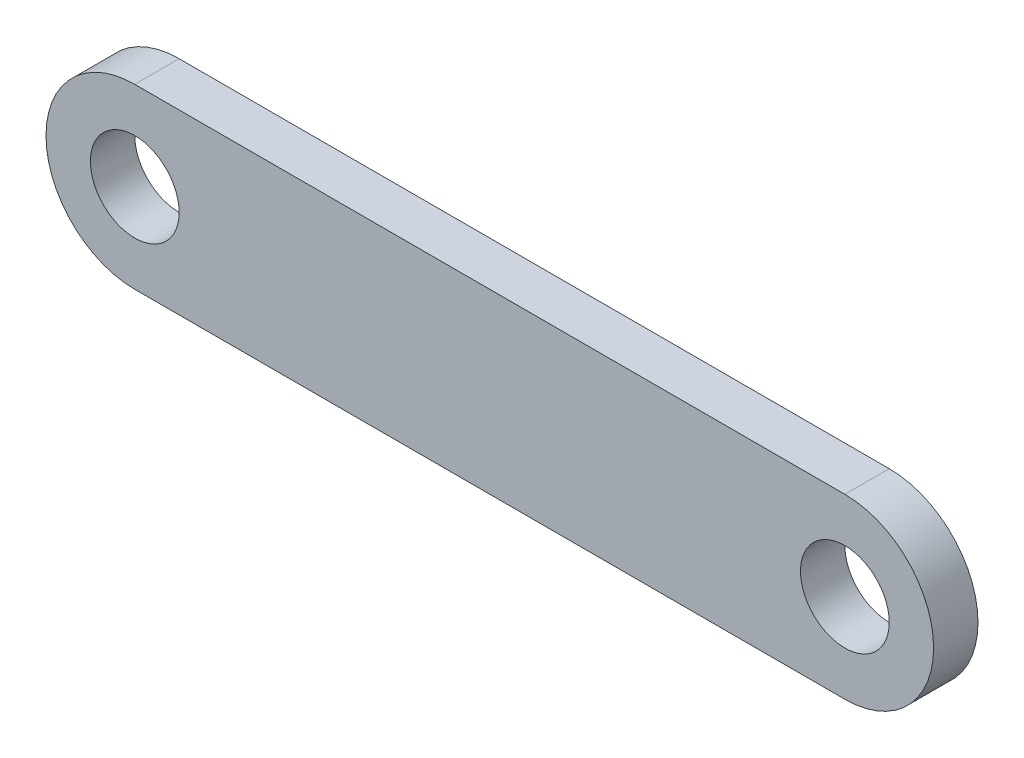
ISO-10303-21;
HEADER;
FILE_DESCRIPTION(('STEP AP214'),'2;1');
FILE_NAME('part.step','',(''),(''),'','','');
FILE_SCHEMA(('AUTOMOTIVE_DESIGN { 1 0 10303 214 1 1 1 1 }'));
ENDSEC;
DATA;
#1=APPLICATION_CONTEXT('core data for automotive mechanical design processes');
#2=APPLICATION_PROTOCOL_DEFINITION('international standard','automotive_design',2000,#1);
#3=PRODUCT_CONTEXT('',#1,'mechanical');
#4=PRODUCT('Part','Part','',(#3));
#5=PRODUCT_RELATED_PRODUCT_CATEGORY('part','',(#4));
#6=PRODUCT_DEFINITION_FORMATION('','',#4);
#7=PRODUCT_DEFINITION_CONTEXT('part definition',#1,'design');
#8=PRODUCT_DEFINITION('design','',#6,#7);
#9=PRODUCT_DEFINITION_SHAPE('','',#8);
#10=(LENGTH_UNIT() NAMED_UNIT(*) SI_UNIT(.MILLI.,.METRE.));
#11=(NAMED_UNIT(*) PLANE_ANGLE_UNIT() SI_UNIT($,.RADIAN.));
#12=(NAMED_UNIT(*) SI_UNIT($,.STERADIAN.) SOLID_ANGLE_UNIT());
#13=UNCERTAINTY_MEASURE_WITH_UNIT(LENGTH_MEASURE(1.E-05),#10,'distance_accuracy_value','');
#14=(GEOMETRIC_REPRESENTATION_CONTEXT(3) GLOBAL_UNCERTAINTY_ASSIGNED_CONTEXT((#13)) GLOBAL_UNIT_ASSIGNED_CONTEXT((#10,
#11,#12)) REPRESENTATION_CONTEXT('',''));
#15=CARTESIAN_POINT('',(0.,0.,0.));
#16=DIRECTION('',(0.,0.,1.));
#17=DIRECTION('',(1.,0.,0.));
#18=AXIS2_PLACEMENT_3D('',#15,#16,#17);
#19=CARTESIAN_POINT('',(-16.,0.,1.));
#20=DIRECTION('',(0.,0.,1.));
#21=DIRECTION('',(1.,0.,0.));
#22=AXIS2_PLACEMENT_3D('',#19,#20,#21);
#23=PLANE('',#22);
#24=CARTESIAN_POINT('',(-16.,0.,1.));
#25=DIRECTION('',(0.,0.,1.));
#26=DIRECTION('',(1.,0.,0.));
#27=AXIS2_PLACEMENT_3D('',#24,#25,#26);
#28=CIRCLE('',#27,2.);
#29=CARTESIAN_POINT('',(-14.,0.,1.));
#30=VERTEX_POINT('',#29);
#31=EDGE_CURVE('E116',#30,#30,#28,.T.);
#32=ORIENTED_EDGE('',*,*,#31,.F.);
#33=EDGE_LOOP('',(#32));
#34=FACE_BOUND('',#33,.T.);
#35=CARTESIAN_POINT('',(-16.,0.,1.));
#36=DIRECTION('',(0.,0.,1.));
#37=DIRECTION('',(1.,0.,0.));
#38=AXIS2_PLACEMENT_3D('',#35,#36,#37);
#39=CIRCLE('',#38,4.);
#40=CARTESIAN_POINT('',(-16.,4.,1.));
#41=VERTEX_POINT('',#40);
#42=CARTESIAN_POINT('',(-16.,-4.,1.));
#43=VERTEX_POINT('',#42);
#44=EDGE_CURVE('E96',#41,#43,#39,.T.);
#45=ORIENTED_EDGE('',*,*,#44,.T.);
#46=DIRECTION('',(1.,0.,0.));
#47=VECTOR('',#46,1.);
#48=CARTESIAN_POINT('',(-16.,-4.,1.));
#49=LINE('',#48,#47);
#50=CARTESIAN_POINT('',(16.,-4.,1.));
#51=VERTEX_POINT('',#50);
#52=EDGE_CURVE('E91',#43,#51,#49,.T.);
#53=ORIENTED_EDGE('',*,*,#52,.T.);
#54=CARTESIAN_POINT('',(16.,0.,1.));
#55=DIRECTION('',(0.,0.,1.));
#56=DIRECTION('',(1.,0.,0.));
#57=AXIS2_PLACEMENT_3D('',#54,#55,#56);
#58=CIRCLE('',#57,4.);
#59=CARTESIAN_POINT('',(16.,4.,1.));
#60=VERTEX_POINT('',#59);
#61=EDGE_CURVE('E94',#51,#60,#58,.T.);
#62=ORIENTED_EDGE('',*,*,#61,.T.);
#63=DIRECTION('',(-1.,0.,0.));
#64=VECTOR('',#63,1.);
#65=CARTESIAN_POINT('',(-16.,4.,1.));
#66=LINE('',#65,#64);
#67=EDGE_CURVE('E61',#60,#41,#66,.T.);
#68=ORIENTED_EDGE('',*,*,#67,.T.);
#69=EDGE_LOOP('',(#45,#53,#62,#68));
#70=FACE_BOUND('',#69,.T.);
#71=CARTESIAN_POINT('',(16.,0.,1.));
#72=DIRECTION('',(0.,0.,1.));
#73=DIRECTION('',(1.,0.,0.));
#74=AXIS2_PLACEMENT_3D('',#71,#72,#73);
#75=CIRCLE('',#74,2.);
#76=CARTESIAN_POINT('',(18.,0.,1.));
#77=VERTEX_POINT('',#76);
#78=EDGE_CURVE('E138',#77,#77,#75,.T.);
#79=ORIENTED_EDGE('',*,*,#78,.F.);
#80=EDGE_LOOP('',(#79));
#81=FACE_BOUND('',#80,.T.);
#82=ADVANCED_FACE('F43',(#34,#70,#81),#23,.T.);
#83=CARTESIAN_POINT('',(-16.,0.,-1.));
#84=DIRECTION('',(0.,0.,1.));
#85=DIRECTION('',(1.,0.,0.));
#86=AXIS2_PLACEMENT_3D('',#83,#84,#85);
#87=PLANE('',#86);
#88=CARTESIAN_POINT('',(-16.,0.,-1.));
#89=DIRECTION('',(0.,0.,1.));
#90=DIRECTION('',(1.,0.,0.));
#91=AXIS2_PLACEMENT_3D('',#88,#89,#90);
#92=CIRCLE('',#91,4.);
#93=CARTESIAN_POINT('',(-16.,4.,-1.));
#94=VERTEX_POINT('',#93);
#95=CARTESIAN_POINT('',(-16.,-4.,-1.));
#96=VERTEX_POINT('',#95);
#97=EDGE_CURVE('E112',#94,#96,#92,.T.);
#98=ORIENTED_EDGE('',*,*,#97,.F.);
#99=DIRECTION('',(-1.,0.,0.));
#100=VECTOR('',#99,1.);
#101=CARTESIAN_POINT('',(-16.,4.,-1.));
#102=LINE('',#101,#100);
#103=CARTESIAN_POINT('',(16.,4.,-1.));
#104=VERTEX_POINT('',#103);
#105=EDGE_CURVE('E84',#104,#94,#102,.T.);
#106=ORIENTED_EDGE('',*,*,#105,.F.);
#107=CARTESIAN_POINT('',(16.,0.,-1.));
#108=DIRECTION('',(0.,0.,1.));
#109=DIRECTION('',(1.,0.,0.));
#110=AXIS2_PLACEMENT_3D('',#107,#108,#109);
#111=CIRCLE('',#110,4.);
#112=CARTESIAN_POINT('',(16.,-4.,-1.));
#113=VERTEX_POINT('',#112);
#114=EDGE_CURVE('E78',#113,#104,#111,.T.);
#115=ORIENTED_EDGE('',*,*,#114,.F.);
#116=DIRECTION('',(1.,0.,0.));
#117=VECTOR('',#116,1.);
#118=CARTESIAN_POINT('',(-16.,-4.,-1.));
#119=LINE('',#118,#117);
#120=EDGE_CURVE('E101',#96,#113,#119,.T.);
#121=ORIENTED_EDGE('',*,*,#120,.F.);
#122=EDGE_LOOP('',(#98,#106,#115,#121));
#123=FACE_BOUND('',#122,.T.);
#124=CARTESIAN_POINT('',(-16.,0.,-1.));
#125=DIRECTION('',(0.,0.,1.));
#126=DIRECTION('',(1.,0.,0.));
#127=AXIS2_PLACEMENT_3D('',#124,#125,#126);
#128=CIRCLE('',#127,2.);
#129=CARTESIAN_POINT('',(-14.,0.,-1.));
#130=VERTEX_POINT('',#129);
#131=EDGE_CURVE('E134',#130,#130,#128,.T.);
#132=ORIENTED_EDGE('',*,*,#131,.T.);
#133=EDGE_LOOP('',(#132));
#134=FACE_BOUND('',#133,.T.);
#135=CARTESIAN_POINT('',(16.,0.,-1.));
#136=DIRECTION('',(0.,0.,1.));
#137=DIRECTION('',(1.,0.,0.));
#138=AXIS2_PLACEMENT_3D('',#135,#136,#137);
#139=CIRCLE('',#138,2.);
#140=CARTESIAN_POINT('',(18.,0.,-1.));
#141=VERTEX_POINT('',#140);
#142=EDGE_CURVE('E142',#141,#141,#139,.T.);
#143=ORIENTED_EDGE('',*,*,#142,.T.);
#144=EDGE_LOOP('',(#143));
#145=FACE_BOUND('',#144,.T.);
#146=ADVANCED_FACE('F129',(#123,#134,#145),#87,.F.);
#147=CARTESIAN_POINT('',(-16.,0.,1.));
#148=DIRECTION('',(0.,0.,-1.));
#149=DIRECTION('',(-1.,0.,0.));
#150=AXIS2_PLACEMENT_3D('',#147,#148,#149);
#151=CYLINDRICAL_SURFACE('',#150,4.);
#152=ORIENTED_EDGE('',*,*,#97,.T.);
#153=DIRECTION('',(0.,0.,-1.));
#154=VECTOR('',#153,1.);
#155=CARTESIAN_POINT('',(-16.,-4.,1.));
#156=LINE('',#155,#154);
#157=EDGE_CURVE('E11',#43,#96,#156,.T.);
#158=ORIENTED_EDGE('',*,*,#157,.F.);
#159=ORIENTED_EDGE('',*,*,#44,.F.);
#160=DIRECTION('',(0.,0.,-1.));
#161=VECTOR('',#160,1.);
#162=CARTESIAN_POINT('',(-16.,4.,1.));
#163=LINE('',#162,#161);
#164=EDGE_CURVE('E108',#41,#94,#163,.T.);
#165=ORIENTED_EDGE('',*,*,#164,.T.);
#166=EDGE_LOOP('',(#152,#158,#159,#165));
#167=FACE_BOUND('',#166,.T.);
#168=ADVANCED_FACE('F45',(#167),#151,.T.);
#169=CARTESIAN_POINT('',(-16.,-4.,1.));
#170=DIRECTION('',(0.,1.,0.));
#171=DIRECTION('',(0.,0.,1.));
#172=AXIS2_PLACEMENT_3D('',#169,#170,#171);
#173=PLANE('',#172);
#174=ORIENTED_EDGE('',*,*,#120,.T.);
#175=DIRECTION('',(0.,0.,-1.));
#176=VECTOR('',#175,1.);
#177=CARTESIAN_POINT('',(16.,-4.,1.));
#178=LINE('',#177,#176);
#179=EDGE_CURVE('E53',#51,#113,#178,.T.);
#180=ORIENTED_EDGE('',*,*,#179,.F.);
#181=ORIENTED_EDGE('',*,*,#52,.F.);
#182=ORIENTED_EDGE('',*,*,#157,.T.);
#183=EDGE_LOOP('',(#174,#180,#181,#182));
#184=FACE_BOUND('',#183,.T.);
#185=ADVANCED_FACE('F100',(#184),#173,.F.);
#186=CARTESIAN_POINT('',(16.,0.,1.));
#187=DIRECTION('',(0.,0.,-1.));
#188=DIRECTION('',(-1.,0.,0.));
#189=AXIS2_PLACEMENT_3D('',#186,#187,#188);
#190=CYLINDRICAL_SURFACE('',#189,4.);
#191=ORIENTED_EDGE('',*,*,#114,.T.);
#192=DIRECTION('',(0.,0.,-1.));
#193=VECTOR('',#192,1.);
#194=CARTESIAN_POINT('',(16.,4.,1.));
#195=LINE('',#194,#193);
#196=EDGE_CURVE('E103',#60,#104,#195,.T.);
#197=ORIENTED_EDGE('',*,*,#196,.F.);
#198=ORIENTED_EDGE('',*,*,#61,.F.);
#199=ORIENTED_EDGE('',*,*,#179,.T.);
#200=EDGE_LOOP('',(#191,#197,#198,#199));
#201=FACE_BOUND('',#200,.T.);
#202=ADVANCED_FACE('F104',(#201),#190,.T.);
#203=CARTESIAN_POINT('',(-16.,4.,1.));
#204=DIRECTION('',(0.,-1.,0.));
#205=DIRECTION('',(0.,0.,-1.));
#206=AXIS2_PLACEMENT_3D('',#203,#204,#205);
#207=PLANE('',#206);
#208=ORIENTED_EDGE('',*,*,#105,.T.);
#209=ORIENTED_EDGE('',*,*,#164,.F.);
#210=ORIENTED_EDGE('',*,*,#67,.F.);
#211=ORIENTED_EDGE('',*,*,#196,.T.);
#212=EDGE_LOOP('',(#208,#209,#210,#211));
#213=FACE_BOUND('',#212,.T.);
#214=ADVANCED_FACE('F126',(#213),#207,.F.);
#215=CARTESIAN_POINT('',(-16.,0.,1.));
#216=DIRECTION('',(0.,0.,-1.));
#217=DIRECTION('',(-1.,0.,0.));
#218=AXIS2_PLACEMENT_3D('',#215,#216,#217);
#219=CYLINDRICAL_SURFACE('',#218,2.);
#220=ORIENTED_EDGE('',*,*,#31,.T.);
#221=EDGE_LOOP('',(#220));
#222=FACE_BOUND('',#221,.T.);
#223=ORIENTED_EDGE('',*,*,#131,.F.);
#224=EDGE_LOOP('',(#223));
#225=FACE_BOUND('',#224,.T.);
#226=ADVANCED_FACE('F161',(#222,#225),#219,.F.);
#227=CARTESIAN_POINT('',(16.,0.,1.));
#228=DIRECTION('',(0.,0.,-1.));
#229=DIRECTION('',(-1.,0.,0.));
#230=AXIS2_PLACEMENT_3D('',#227,#228,#229);
#231=CYLINDRICAL_SURFACE('',#230,2.);
#232=ORIENTED_EDGE('',*,*,#78,.T.);
#233=EDGE_LOOP('',(#232));
#234=FACE_BOUND('',#233,.T.);
#235=ORIENTED_EDGE('',*,*,#142,.F.);
#236=EDGE_LOOP('',(#235));
#237=FACE_BOUND('',#236,.T.);
#238=ADVANCED_FACE('F150',(#234,#237),#231,.F.);
#239=CLOSED_SHELL('',(#82,#146,#168,#185,#202,#214,#226,#238));
#240=MANIFOLD_SOLID_BREP('B2',#239);
#241=ADVANCED_BREP_SHAPE_REPRESENTATION('',(#18,#240),#14);
#242=SHAPE_DEFINITION_REPRESENTATION(#9,#241);
ENDSEC;
END-ISO-10303-21;
